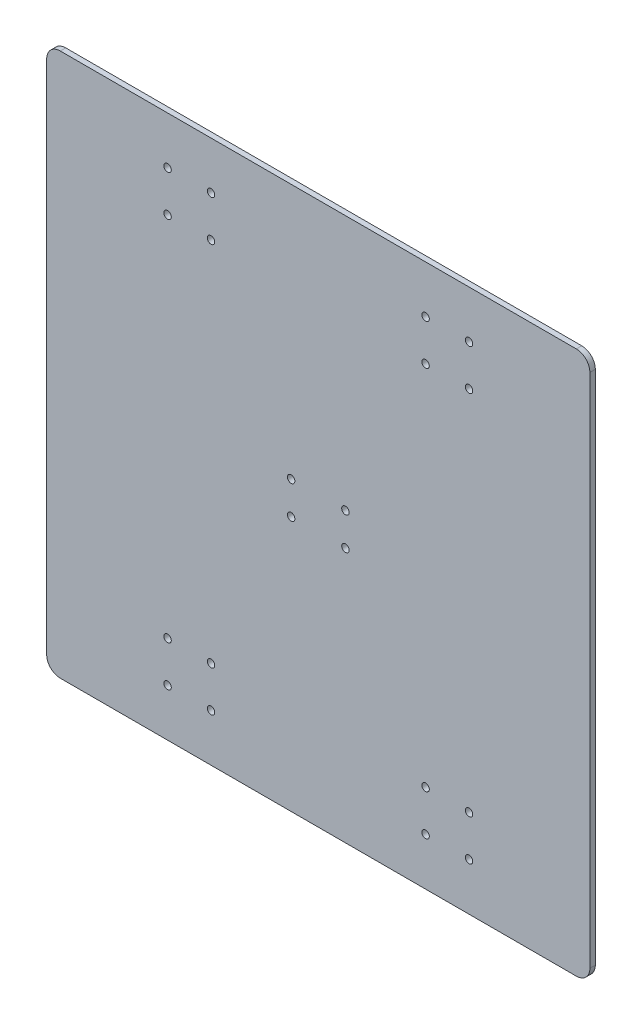
ISO-10303-21;
HEADER;
FILE_DESCRIPTION(('STEP AP214'),'2;1');
FILE_NAME('part.step','',(''),(''),'','','');
FILE_SCHEMA(('AUTOMOTIVE_DESIGN { 1 0 10303 214 1 1 1 1 }'));
ENDSEC;
DATA;
#1=APPLICATION_CONTEXT('core data for automotive mechanical design processes');
#2=APPLICATION_PROTOCOL_DEFINITION('international standard','automotive_design',2000,#1);
#3=PRODUCT_CONTEXT('',#1,'mechanical');
#4=PRODUCT('Part','Part','',(#3));
#5=PRODUCT_RELATED_PRODUCT_CATEGORY('part','',(#4));
#6=PRODUCT_DEFINITION_FORMATION('','',#4);
#7=PRODUCT_DEFINITION_CONTEXT('part definition',#1,'design');
#8=PRODUCT_DEFINITION('design','',#6,#7);
#9=PRODUCT_DEFINITION_SHAPE('','',#8);
#10=(LENGTH_UNIT() NAMED_UNIT(*) SI_UNIT(.MILLI.,.METRE.));
#11=(NAMED_UNIT(*) PLANE_ANGLE_UNIT() SI_UNIT($,.RADIAN.));
#12=(NAMED_UNIT(*) SI_UNIT($,.STERADIAN.) SOLID_ANGLE_UNIT());
#13=UNCERTAINTY_MEASURE_WITH_UNIT(LENGTH_MEASURE(1.E-05),#10,'distance_accuracy_value','');
#14=(GEOMETRIC_REPRESENTATION_CONTEXT(3) GLOBAL_UNCERTAINTY_ASSIGNED_CONTEXT((#13)) GLOBAL_UNIT_ASSIGNED_CONTEXT((#10,
#11,#12)) REPRESENTATION_CONTEXT('',''));
#15=CARTESIAN_POINT('',(0.,0.,0.));
#16=DIRECTION('',(0.,0.,1.));
#17=DIRECTION('',(1.,0.,0.));
#18=AXIS2_PLACEMENT_3D('',#15,#16,#17);
#19=CARTESIAN_POINT('',(0.,0.,4.));
#20=DIRECTION('',(0.,0.,-1.));
#21=DIRECTION('',(-1.,0.,0.));
#22=AXIS2_PLACEMENT_3D('',#19,#20,#21);
#23=PLANE('',#22);
#24=CARTESIAN_POINT('',(20.,12.,4.));
#25=DIRECTION('',(0.,0.,1.));
#26=DIRECTION('',(1.,0.,0.));
#27=AXIS2_PLACEMENT_3D('',#24,#25,#26);
#28=CIRCLE('',#27,2.74999999999999);
#29=CARTESIAN_POINT('',(22.75,12.,4.));
#30=VERTEX_POINT('',#29);
#31=EDGE_CURVE('E297',#30,#30,#28,.T.);
#32=ORIENTED_EDGE('',*,*,#31,.F.);
#33=EDGE_LOOP('',(#32));
#34=FACE_BOUND('',#33,.T.);
#35=CARTESIAN_POINT('',(-20.,12.,4.));
#36=DIRECTION('',(0.,0.,1.));
#37=DIRECTION('',(1.,0.,0.));
#38=AXIS2_PLACEMENT_3D('',#35,#36,#37);
#39=CIRCLE('',#38,2.74999999999999);
#40=CARTESIAN_POINT('',(-17.25,12.,4.));
#41=VERTEX_POINT('',#40);
#42=EDGE_CURVE('E291',#41,#41,#39,.T.);
#43=ORIENTED_EDGE('',*,*,#42,.F.);
#44=EDGE_LOOP('',(#43));
#45=FACE_BOUND('',#44,.T.);
#46=CARTESIAN_POINT('',(-20.,-12.,4.));
#47=DIRECTION('',(0.,0.,1.));
#48=DIRECTION('',(1.,0.,0.));
#49=AXIS2_PLACEMENT_3D('',#46,#47,#48);
#50=CIRCLE('',#49,2.74999999999999);
#51=CARTESIAN_POINT('',(-17.25,-12.,4.));
#52=VERTEX_POINT('',#51);
#53=EDGE_CURVE('E285',#52,#52,#50,.T.);
#54=ORIENTED_EDGE('',*,*,#53,.F.);
#55=EDGE_LOOP('',(#54));
#56=FACE_BOUND('',#55,.T.);
#57=CARTESIAN_POINT('',(79.,-165.,4.));
#58=DIRECTION('',(0.,0.,1.));
#59=DIRECTION('',(1.,0.,0.));
#60=AXIS2_PLACEMENT_3D('',#57,#58,#59);
#61=CIRCLE('',#60,2.75);
#62=CARTESIAN_POINT('',(81.75,-165.,4.));
#63=VERTEX_POINT('',#62);
#64=EDGE_CURVE('E270',#63,#63,#61,.T.);
#65=ORIENTED_EDGE('',*,*,#64,.F.);
#66=EDGE_LOOP('',(#65));
#67=FACE_BOUND('',#66,.T.);
#68=CARTESIAN_POINT('',(111.,-165.,4.));
#69=DIRECTION('',(0.,0.,1.));
#70=DIRECTION('',(1.,0.,0.));
#71=AXIS2_PLACEMENT_3D('',#68,#69,#70);
#72=CIRCLE('',#71,2.75);
#73=CARTESIAN_POINT('',(113.75,-165.,4.));
#74=VERTEX_POINT('',#73);
#75=EDGE_CURVE('E264',#74,#74,#72,.T.);
#76=ORIENTED_EDGE('',*,*,#75,.F.);
#77=EDGE_LOOP('',(#76));
#78=FACE_BOUND('',#77,.T.);
#79=CARTESIAN_POINT('',(111.,-135.,4.));
#80=DIRECTION('',(0.,0.,1.));
#81=DIRECTION('',(1.,0.,0.));
#82=AXIS2_PLACEMENT_3D('',#79,#80,#81);
#83=CIRCLE('',#82,2.75);
#84=CARTESIAN_POINT('',(113.75,-135.,4.));
#85=VERTEX_POINT('',#84);
#86=EDGE_CURVE('E258',#85,#85,#83,.T.);
#87=ORIENTED_EDGE('',*,*,#86,.F.);
#88=EDGE_LOOP('',(#87));
#89=FACE_BOUND('',#88,.T.);
#90=CARTESIAN_POINT('',(79.,-135.,4.));
#91=DIRECTION('',(0.,0.,1.));
#92=DIRECTION('',(1.,0.,0.));
#93=AXIS2_PLACEMENT_3D('',#90,#91,#92);
#94=CIRCLE('',#93,2.75);
#95=CARTESIAN_POINT('',(81.75,-135.,4.));
#96=VERTEX_POINT('',#95);
#97=EDGE_CURVE('E252',#96,#96,#94,.T.);
#98=ORIENTED_EDGE('',*,*,#97,.F.);
#99=EDGE_LOOP('',(#98));
#100=FACE_BOUND('',#99,.T.);
#101=CARTESIAN_POINT('',(79.,165.,4.));
#102=DIRECTION('',(0.,0.,1.));
#103=DIRECTION('',(1.,0.,0.));
#104=AXIS2_PLACEMENT_3D('',#101,#102,#103);
#105=CIRCLE('',#104,2.75);
#106=CARTESIAN_POINT('',(81.75,165.,4.));
#107=VERTEX_POINT('',#106);
#108=EDGE_CURVE('E249',#107,#107,#105,.T.);
#109=ORIENTED_EDGE('',*,*,#108,.F.);
#110=EDGE_LOOP('',(#109));
#111=FACE_BOUND('',#110,.T.);
#112=CARTESIAN_POINT('',(79.,135.,4.));
#113=DIRECTION('',(0.,0.,1.));
#114=DIRECTION('',(1.,0.,0.));
#115=AXIS2_PLACEMENT_3D('',#112,#113,#114);
#116=CIRCLE('',#115,2.75);
#117=CARTESIAN_POINT('',(81.75,135.,4.));
#118=VERTEX_POINT('',#117);
#119=EDGE_CURVE('E243',#118,#118,#116,.T.);
#120=ORIENTED_EDGE('',*,*,#119,.F.);
#121=EDGE_LOOP('',(#120));
#122=FACE_BOUND('',#121,.T.);
#123=CARTESIAN_POINT('',(111.,135.,4.));
#124=DIRECTION('',(0.,0.,1.));
#125=DIRECTION('',(1.,0.,0.));
#126=AXIS2_PLACEMENT_3D('',#123,#124,#125);
#127=CIRCLE('',#126,2.75);
#128=CARTESIAN_POINT('',(113.75,135.,4.));
#129=VERTEX_POINT('',#128);
#130=EDGE_CURVE('E237',#129,#129,#127,.T.);
#131=ORIENTED_EDGE('',*,*,#130,.F.);
#132=EDGE_LOOP('',(#131));
#133=FACE_BOUND('',#132,.T.);
#134=CARTESIAN_POINT('',(111.,165.,4.));
#135=DIRECTION('',(0.,0.,1.));
#136=DIRECTION('',(1.,0.,0.));
#137=AXIS2_PLACEMENT_3D('',#134,#135,#136);
#138=CIRCLE('',#137,2.75);
#139=CARTESIAN_POINT('',(113.75,165.,4.));
#140=VERTEX_POINT('',#139);
#141=EDGE_CURVE('E137',#140,#140,#138,.T.);
#142=ORIENTED_EDGE('',*,*,#141,.F.);
#143=EDGE_LOOP('',(#142));
#144=FACE_BOUND('',#143,.T.);
#145=DIRECTION('',(1.,0.,0.));
#146=VECTOR('',#145,1.);
#147=CARTESIAN_POINT('',(-200.,-200.,4.));
#148=LINE('',#147,#146);
#149=CARTESIAN_POINT('',(-190.,-200.,4.));
#150=VERTEX_POINT('',#149);
#151=CARTESIAN_POINT('',(190.,-200.,4.));
#152=VERTEX_POINT('',#151);
#153=EDGE_CURVE('E140',#150,#152,#148,.T.);
#154=ORIENTED_EDGE('',*,*,#153,.T.);
#155=CARTESIAN_POINT('',(190.,-190.,4.));
#156=DIRECTION('',(0.,0.,-1.));
#157=DIRECTION('',(-1.,0.,0.));
#158=AXIS2_PLACEMENT_3D('',#155,#156,#157);
#159=CIRCLE('',#158,10.);
#160=CARTESIAN_POINT('',(200.,-190.,4.));
#161=VERTEX_POINT('',#160);
#162=EDGE_CURVE('E207',#152,#161,#159,.F.);
#163=ORIENTED_EDGE('',*,*,#162,.T.);
#164=DIRECTION('',(0.,1.,0.));
#165=VECTOR('',#164,1.);
#166=CARTESIAN_POINT('',(200.,-200.,4.));
#167=LINE('',#166,#165);
#168=CARTESIAN_POINT('',(200.,190.,4.));
#169=VERTEX_POINT('',#168);
#170=EDGE_CURVE('E123',#161,#169,#167,.T.);
#171=ORIENTED_EDGE('',*,*,#170,.T.);
#172=CARTESIAN_POINT('',(190.,190.,4.));
#173=DIRECTION('',(0.,0.,-1.));
#174=DIRECTION('',(-1.,0.,0.));
#175=AXIS2_PLACEMENT_3D('',#172,#173,#174);
#176=CIRCLE('',#175,10.);
#177=CARTESIAN_POINT('',(190.,200.,4.));
#178=VERTEX_POINT('',#177);
#179=EDGE_CURVE('E202',#169,#178,#176,.F.);
#180=ORIENTED_EDGE('',*,*,#179,.T.);
#181=DIRECTION('',(-1.,0.,0.));
#182=VECTOR('',#181,1.);
#183=CARTESIAN_POINT('',(-200.,200.,4.));
#184=LINE('',#183,#182);
#185=CARTESIAN_POINT('',(-190.,200.,4.));
#186=VERTEX_POINT('',#185);
#187=EDGE_CURVE('E218',#178,#186,#184,.T.);
#188=ORIENTED_EDGE('',*,*,#187,.T.);
#189=CARTESIAN_POINT('',(-190.,190.,4.));
#190=DIRECTION('',(0.,0.,-1.));
#191=DIRECTION('',(-1.,0.,0.));
#192=AXIS2_PLACEMENT_3D('',#189,#190,#191);
#193=CIRCLE('',#192,10.);
#194=CARTESIAN_POINT('',(-200.,190.,4.));
#195=VERTEX_POINT('',#194);
#196=EDGE_CURVE('E59',#186,#195,#193,.F.);
#197=ORIENTED_EDGE('',*,*,#196,.T.);
#198=DIRECTION('',(0.,-1.,0.));
#199=VECTOR('',#198,1.);
#200=CARTESIAN_POINT('',(-200.,-200.,4.));
#201=LINE('',#200,#199);
#202=CARTESIAN_POINT('',(-200.,-190.,4.));
#203=VERTEX_POINT('',#202);
#204=EDGE_CURVE('E226',#195,#203,#201,.T.);
#205=ORIENTED_EDGE('',*,*,#204,.T.);
#206=CARTESIAN_POINT('',(-190.,-190.,4.));
#207=DIRECTION('',(0.,0.,-1.));
#208=DIRECTION('',(-1.,0.,0.));
#209=AXIS2_PLACEMENT_3D('',#206,#207,#208);
#210=CIRCLE('',#209,10.);
#211=EDGE_CURVE('E205',#203,#150,#210,.F.);
#212=ORIENTED_EDGE('',*,*,#211,.T.);
#213=EDGE_LOOP('',(#154,#163,#171,#180,#188,#197,#205,#212));
#214=FACE_BOUND('',#213,.T.);
#215=CARTESIAN_POINT('',(-111.,165.,4.));
#216=DIRECTION('',(0.,0.,1.));
#217=DIRECTION('',(1.,0.,0.));
#218=AXIS2_PLACEMENT_3D('',#215,#216,#217);
#219=CIRCLE('',#218,2.75);
#220=CARTESIAN_POINT('',(-108.25,165.,4.));
#221=VERTEX_POINT('',#220);
#222=EDGE_CURVE('E149',#221,#221,#219,.T.);
#223=ORIENTED_EDGE('',*,*,#222,.F.);
#224=EDGE_LOOP('',(#223));
#225=FACE_BOUND('',#224,.T.);
#226=CARTESIAN_POINT('',(-111.,-135.,4.));
#227=DIRECTION('',(0.,0.,1.));
#228=DIRECTION('',(1.,0.,0.));
#229=AXIS2_PLACEMENT_3D('',#226,#227,#228);
#230=CIRCLE('',#229,2.75);
#231=CARTESIAN_POINT('',(-108.25,-135.,4.));
#232=VERTEX_POINT('',#231);
#233=EDGE_CURVE('E155',#232,#232,#230,.T.);
#234=ORIENTED_EDGE('',*,*,#233,.F.);
#235=EDGE_LOOP('',(#234));
#236=FACE_BOUND('',#235,.T.);
#237=CARTESIAN_POINT('',(-79.,165.,4.));
#238=DIRECTION('',(0.,0.,1.));
#239=DIRECTION('',(1.,0.,0.));
#240=AXIS2_PLACEMENT_3D('',#237,#238,#239);
#241=CIRCLE('',#240,2.75);
#242=CARTESIAN_POINT('',(-76.25,165.,4.));
#243=VERTEX_POINT('',#242);
#244=EDGE_CURVE('E161',#243,#243,#241,.T.);
#245=ORIENTED_EDGE('',*,*,#244,.F.);
#246=EDGE_LOOP('',(#245));
#247=FACE_BOUND('',#246,.T.);
#248=CARTESIAN_POINT('',(-79.,-135.,4.));
#249=DIRECTION('',(0.,0.,1.));
#250=DIRECTION('',(1.,0.,0.));
#251=AXIS2_PLACEMENT_3D('',#248,#249,#250);
#252=CIRCLE('',#251,2.75);
#253=CARTESIAN_POINT('',(-76.25,-135.,4.));
#254=VERTEX_POINT('',#253);
#255=EDGE_CURVE('E167',#254,#254,#252,.T.);
#256=ORIENTED_EDGE('',*,*,#255,.F.);
#257=EDGE_LOOP('',(#256));
#258=FACE_BOUND('',#257,.T.);
#259=CARTESIAN_POINT('',(-79.,135.,4.));
#260=DIRECTION('',(0.,0.,1.));
#261=DIRECTION('',(1.,0.,0.));
#262=AXIS2_PLACEMENT_3D('',#259,#260,#261);
#263=CIRCLE('',#262,2.75);
#264=CARTESIAN_POINT('',(-76.25,135.,4.));
#265=VERTEX_POINT('',#264);
#266=EDGE_CURVE('E173',#265,#265,#263,.T.);
#267=ORIENTED_EDGE('',*,*,#266,.F.);
#268=EDGE_LOOP('',(#267));
#269=FACE_BOUND('',#268,.T.);
#270=CARTESIAN_POINT('',(-79.,-165.,4.));
#271=DIRECTION('',(0.,0.,1.));
#272=DIRECTION('',(1.,0.,0.));
#273=AXIS2_PLACEMENT_3D('',#270,#271,#272);
#274=CIRCLE('',#273,2.75);
#275=CARTESIAN_POINT('',(-76.25,-165.,4.));
#276=VERTEX_POINT('',#275);
#277=EDGE_CURVE('E179',#276,#276,#274,.T.);
#278=ORIENTED_EDGE('',*,*,#277,.F.);
#279=EDGE_LOOP('',(#278));
#280=FACE_BOUND('',#279,.T.);
#281=CARTESIAN_POINT('',(-111.,135.,4.));
#282=DIRECTION('',(0.,0.,1.));
#283=DIRECTION('',(1.,0.,0.));
#284=AXIS2_PLACEMENT_3D('',#281,#282,#283);
#285=CIRCLE('',#284,2.75);
#286=CARTESIAN_POINT('',(-108.25,135.,4.));
#287=VERTEX_POINT('',#286);
#288=EDGE_CURVE('E185',#287,#287,#285,.T.);
#289=ORIENTED_EDGE('',*,*,#288,.F.);
#290=EDGE_LOOP('',(#289));
#291=FACE_BOUND('',#290,.T.);
#292=CARTESIAN_POINT('',(-111.,-165.,4.));
#293=DIRECTION('',(0.,0.,1.));
#294=DIRECTION('',(1.,0.,0.));
#295=AXIS2_PLACEMENT_3D('',#292,#293,#294);
#296=CIRCLE('',#295,2.75);
#297=CARTESIAN_POINT('',(-108.25,-165.,4.));
#298=VERTEX_POINT('',#297);
#299=EDGE_CURVE('E191',#298,#298,#296,.T.);
#300=ORIENTED_EDGE('',*,*,#299,.F.);
#301=EDGE_LOOP('',(#300));
#302=FACE_BOUND('',#301,.T.);
#303=CARTESIAN_POINT('',(20.,-12.,4.));
#304=DIRECTION('',(0.,0.,1.));
#305=DIRECTION('',(1.,0.,0.));
#306=AXIS2_PLACEMENT_3D('',#303,#304,#305);
#307=CIRCLE('',#306,2.74999999999999);
#308=CARTESIAN_POINT('',(22.75,-12.,4.));
#309=VERTEX_POINT('',#308);
#310=EDGE_CURVE('E279',#309,#309,#307,.T.);
#311=ORIENTED_EDGE('',*,*,#310,.F.);
#312=EDGE_LOOP('',(#311));
#313=FACE_BOUND('',#312,.T.);
#314=ADVANCED_FACE('F37',(#34,#45,#56,#67,#78,#89,#100,#111,#122,#133,#144,#214,#225,#236,#247,
#258,#269,#280,#291,#302,#313),#23,.F.);
#315=CARTESIAN_POINT('',(0.,0.,0.));
#316=DIRECTION('',(0.,0.,-1.));
#317=DIRECTION('',(-1.,0.,0.));
#318=AXIS2_PLACEMENT_3D('',#315,#316,#317);
#319=PLANE('',#318);
#320=CARTESIAN_POINT('',(20.,12.,0.));
#321=DIRECTION('',(0.,0.,1.));
#322=DIRECTION('',(1.,0.,0.));
#323=AXIS2_PLACEMENT_3D('',#320,#321,#322);
#324=CIRCLE('',#323,2.75);
#325=CARTESIAN_POINT('',(22.75,12.,0.));
#326=VERTEX_POINT('',#325);
#327=EDGE_CURVE('E294',#326,#326,#324,.T.);
#328=ORIENTED_EDGE('',*,*,#327,.T.);
#329=EDGE_LOOP('',(#328));
#330=FACE_BOUND('',#329,.T.);
#331=CARTESIAN_POINT('',(-20.,12.,0.));
#332=DIRECTION('',(0.,0.,1.));
#333=DIRECTION('',(1.,0.,0.));
#334=AXIS2_PLACEMENT_3D('',#331,#332,#333);
#335=CIRCLE('',#334,2.75);
#336=CARTESIAN_POINT('',(-17.25,12.,0.));
#337=VERTEX_POINT('',#336);
#338=EDGE_CURVE('E288',#337,#337,#335,.T.);
#339=ORIENTED_EDGE('',*,*,#338,.T.);
#340=EDGE_LOOP('',(#339));
#341=FACE_BOUND('',#340,.T.);
#342=CARTESIAN_POINT('',(-20.,-12.,0.));
#343=DIRECTION('',(0.,0.,1.));
#344=DIRECTION('',(1.,0.,0.));
#345=AXIS2_PLACEMENT_3D('',#342,#343,#344);
#346=CIRCLE('',#345,2.75);
#347=CARTESIAN_POINT('',(-17.25,-12.,0.));
#348=VERTEX_POINT('',#347);
#349=EDGE_CURVE('E282',#348,#348,#346,.T.);
#350=ORIENTED_EDGE('',*,*,#349,.T.);
#351=EDGE_LOOP('',(#350));
#352=FACE_BOUND('',#351,.T.);
#353=CARTESIAN_POINT('',(-111.,-165.,0.));
#354=DIRECTION('',(0.,0.,1.));
#355=DIRECTION('',(1.,0.,0.));
#356=AXIS2_PLACEMENT_3D('',#353,#354,#355);
#357=CIRCLE('',#356,2.75);
#358=CARTESIAN_POINT('',(-108.25,-165.,0.));
#359=VERTEX_POINT('',#358);
#360=EDGE_CURVE('E188',#359,#359,#357,.T.);
#361=ORIENTED_EDGE('',*,*,#360,.T.);
#362=EDGE_LOOP('',(#361));
#363=FACE_BOUND('',#362,.T.);
#364=CARTESIAN_POINT('',(-111.,135.,0.));
#365=DIRECTION('',(0.,0.,1.));
#366=DIRECTION('',(1.,0.,0.));
#367=AXIS2_PLACEMENT_3D('',#364,#365,#366);
#368=CIRCLE('',#367,2.75);
#369=CARTESIAN_POINT('',(-108.25,135.,0.));
#370=VERTEX_POINT('',#369);
#371=EDGE_CURVE('E182',#370,#370,#368,.T.);
#372=ORIENTED_EDGE('',*,*,#371,.T.);
#373=EDGE_LOOP('',(#372));
#374=FACE_BOUND('',#373,.T.);
#375=CARTESIAN_POINT('',(-79.,-165.,0.));
#376=DIRECTION('',(0.,0.,1.));
#377=DIRECTION('',(1.,0.,0.));
#378=AXIS2_PLACEMENT_3D('',#375,#376,#377);
#379=CIRCLE('',#378,2.75);
#380=CARTESIAN_POINT('',(-76.25,-165.,0.));
#381=VERTEX_POINT('',#380);
#382=EDGE_CURVE('E176',#381,#381,#379,.T.);
#383=ORIENTED_EDGE('',*,*,#382,.T.);
#384=EDGE_LOOP('',(#383));
#385=FACE_BOUND('',#384,.T.);
#386=CARTESIAN_POINT('',(-79.,135.,0.));
#387=DIRECTION('',(0.,0.,1.));
#388=DIRECTION('',(1.,0.,0.));
#389=AXIS2_PLACEMENT_3D('',#386,#387,#388);
#390=CIRCLE('',#389,2.75);
#391=CARTESIAN_POINT('',(-76.25,135.,0.));
#392=VERTEX_POINT('',#391);
#393=EDGE_CURVE('E170',#392,#392,#390,.T.);
#394=ORIENTED_EDGE('',*,*,#393,.T.);
#395=EDGE_LOOP('',(#394));
#396=FACE_BOUND('',#395,.T.);
#397=CARTESIAN_POINT('',(-79.,-135.,0.));
#398=DIRECTION('',(0.,0.,1.));
#399=DIRECTION('',(1.,0.,0.));
#400=AXIS2_PLACEMENT_3D('',#397,#398,#399);
#401=CIRCLE('',#400,2.75);
#402=CARTESIAN_POINT('',(-76.25,-135.,0.));
#403=VERTEX_POINT('',#402);
#404=EDGE_CURVE('E164',#403,#403,#401,.T.);
#405=ORIENTED_EDGE('',*,*,#404,.T.);
#406=EDGE_LOOP('',(#405));
#407=FACE_BOUND('',#406,.T.);
#408=CARTESIAN_POINT('',(-79.,165.,0.));
#409=DIRECTION('',(0.,0.,1.));
#410=DIRECTION('',(1.,0.,0.));
#411=AXIS2_PLACEMENT_3D('',#408,#409,#410);
#412=CIRCLE('',#411,2.75);
#413=CARTESIAN_POINT('',(-76.25,165.,0.));
#414=VERTEX_POINT('',#413);
#415=EDGE_CURVE('E158',#414,#414,#412,.T.);
#416=ORIENTED_EDGE('',*,*,#415,.T.);
#417=EDGE_LOOP('',(#416));
#418=FACE_BOUND('',#417,.T.);
#419=CARTESIAN_POINT('',(-111.,-135.,0.));
#420=DIRECTION('',(0.,0.,1.));
#421=DIRECTION('',(1.,0.,0.));
#422=AXIS2_PLACEMENT_3D('',#419,#420,#421);
#423=CIRCLE('',#422,2.75);
#424=CARTESIAN_POINT('',(-108.25,-135.,0.));
#425=VERTEX_POINT('',#424);
#426=EDGE_CURVE('E152',#425,#425,#423,.T.);
#427=ORIENTED_EDGE('',*,*,#426,.T.);
#428=EDGE_LOOP('',(#427));
#429=FACE_BOUND('',#428,.T.);
#430=CARTESIAN_POINT('',(-111.,165.,0.));
#431=DIRECTION('',(0.,0.,1.));
#432=DIRECTION('',(1.,0.,0.));
#433=AXIS2_PLACEMENT_3D('',#430,#431,#432);
#434=CIRCLE('',#433,2.75);
#435=CARTESIAN_POINT('',(-108.25,165.,0.));
#436=VERTEX_POINT('',#435);
#437=EDGE_CURVE('E146',#436,#436,#434,.T.);
#438=ORIENTED_EDGE('',*,*,#437,.T.);
#439=EDGE_LOOP('',(#438));
#440=FACE_BOUND('',#439,.T.);
#441=DIRECTION('',(0.,1.,0.));
#442=VECTOR('',#441,1.);
#443=CARTESIAN_POINT('',(200.,-200.,0.));
#444=LINE('',#443,#442);
#445=CARTESIAN_POINT('',(200.,-190.,0.));
#446=VERTEX_POINT('',#445);
#447=CARTESIAN_POINT('',(200.,190.,0.));
#448=VERTEX_POINT('',#447);
#449=EDGE_CURVE('E120',#446,#448,#444,.T.);
#450=ORIENTED_EDGE('',*,*,#449,.F.);
#451=CARTESIAN_POINT('',(190.,-190.,0.));
#452=DIRECTION('',(0.,0.,-1.));
#453=DIRECTION('',(-1.,0.,0.));
#454=AXIS2_PLACEMENT_3D('',#451,#452,#453);
#455=CIRCLE('',#454,10.);
#456=CARTESIAN_POINT('',(190.,-200.,0.));
#457=VERTEX_POINT('',#456);
#458=EDGE_CURVE('E103',#446,#457,#455,.T.);
#459=ORIENTED_EDGE('',*,*,#458,.T.);
#460=DIRECTION('',(1.,0.,0.));
#461=VECTOR('',#460,1.);
#462=CARTESIAN_POINT('',(-200.,-200.,0.));
#463=LINE('',#462,#461);
#464=CARTESIAN_POINT('',(-190.,-200.,0.));
#465=VERTEX_POINT('',#464);
#466=EDGE_CURVE('E144',#465,#457,#463,.T.);
#467=ORIENTED_EDGE('',*,*,#466,.F.);
#468=CARTESIAN_POINT('',(-190.,-190.,0.));
#469=DIRECTION('',(0.,0.,-1.));
#470=DIRECTION('',(-1.,0.,0.));
#471=AXIS2_PLACEMENT_3D('',#468,#469,#470);
#472=CIRCLE('',#471,10.);
#473=CARTESIAN_POINT('',(-200.,-190.,0.));
#474=VERTEX_POINT('',#473);
#475=EDGE_CURVE('E114',#465,#474,#472,.T.);
#476=ORIENTED_EDGE('',*,*,#475,.T.);
#477=DIRECTION('',(0.,-1.,0.));
#478=VECTOR('',#477,1.);
#479=CARTESIAN_POINT('',(-200.,-200.,0.));
#480=LINE('',#479,#478);
#481=CARTESIAN_POINT('',(-200.,190.,0.));
#482=VERTEX_POINT('',#481);
#483=EDGE_CURVE('E134',#482,#474,#480,.T.);
#484=ORIENTED_EDGE('',*,*,#483,.F.);
#485=CARTESIAN_POINT('',(-190.,190.,0.));
#486=DIRECTION('',(0.,0.,-1.));
#487=DIRECTION('',(-1.,0.,0.));
#488=AXIS2_PLACEMENT_3D('',#485,#486,#487);
#489=CIRCLE('',#488,10.);
#490=CARTESIAN_POINT('',(-190.,200.,0.));
#491=VERTEX_POINT('',#490);
#492=EDGE_CURVE('E196',#482,#491,#489,.T.);
#493=ORIENTED_EDGE('',*,*,#492,.T.);
#494=DIRECTION('',(-1.,0.,0.));
#495=VECTOR('',#494,1.);
#496=CARTESIAN_POINT('',(-200.,200.,0.));
#497=LINE('',#496,#495);
#498=CARTESIAN_POINT('',(190.,200.,0.));
#499=VERTEX_POINT('',#498);
#500=EDGE_CURVE('E130',#499,#491,#497,.T.);
#501=ORIENTED_EDGE('',*,*,#500,.F.);
#502=CARTESIAN_POINT('',(190.,190.,0.));
#503=DIRECTION('',(0.,0.,-1.));
#504=DIRECTION('',(-1.,0.,0.));
#505=AXIS2_PLACEMENT_3D('',#502,#503,#504);
#506=CIRCLE('',#505,10.);
#507=EDGE_CURVE('E124',#499,#448,#506,.T.);
#508=ORIENTED_EDGE('',*,*,#507,.T.);
#509=EDGE_LOOP('',(#450,#459,#467,#476,#484,#493,#501,#508));
#510=FACE_BOUND('',#509,.T.);
#511=CARTESIAN_POINT('',(111.,165.,0.));
#512=DIRECTION('',(0.,0.,1.));
#513=DIRECTION('',(1.,0.,0.));
#514=AXIS2_PLACEMENT_3D('',#511,#512,#513);
#515=CIRCLE('',#514,2.75);
#516=CARTESIAN_POINT('',(113.75,165.,0.));
#517=VERTEX_POINT('',#516);
#518=EDGE_CURVE('E131',#517,#517,#515,.T.);
#519=ORIENTED_EDGE('',*,*,#518,.T.);
#520=EDGE_LOOP('',(#519));
#521=FACE_BOUND('',#520,.T.);
#522=CARTESIAN_POINT('',(111.,135.,0.));
#523=DIRECTION('',(0.,0.,1.));
#524=DIRECTION('',(1.,0.,0.));
#525=AXIS2_PLACEMENT_3D('',#522,#523,#524);
#526=CIRCLE('',#525,2.75);
#527=CARTESIAN_POINT('',(113.75,135.,0.));
#528=VERTEX_POINT('',#527);
#529=EDGE_CURVE('E234',#528,#528,#526,.T.);
#530=ORIENTED_EDGE('',*,*,#529,.T.);
#531=EDGE_LOOP('',(#530));
#532=FACE_BOUND('',#531,.T.);
#533=CARTESIAN_POINT('',(79.,135.,0.));
#534=DIRECTION('',(0.,0.,1.));
#535=DIRECTION('',(1.,0.,0.));
#536=AXIS2_PLACEMENT_3D('',#533,#534,#535);
#537=CIRCLE('',#536,2.75);
#538=CARTESIAN_POINT('',(81.75,135.,0.));
#539=VERTEX_POINT('',#538);
#540=EDGE_CURVE('E240',#539,#539,#537,.T.);
#541=ORIENTED_EDGE('',*,*,#540,.T.);
#542=EDGE_LOOP('',(#541));
#543=FACE_BOUND('',#542,.T.);
#544=CARTESIAN_POINT('',(79.,165.,0.));
#545=DIRECTION('',(0.,0.,1.));
#546=DIRECTION('',(1.,0.,0.));
#547=AXIS2_PLACEMENT_3D('',#544,#545,#546);
#548=CIRCLE('',#547,2.75);
#549=CARTESIAN_POINT('',(81.75,165.,0.));
#550=VERTEX_POINT('',#549);
#551=EDGE_CURVE('E246',#550,#550,#548,.T.);
#552=ORIENTED_EDGE('',*,*,#551,.T.);
#553=EDGE_LOOP('',(#552));
#554=FACE_BOUND('',#553,.T.);
#555=CARTESIAN_POINT('',(79.,-135.,0.));
#556=DIRECTION('',(0.,0.,1.));
#557=DIRECTION('',(1.,0.,0.));
#558=AXIS2_PLACEMENT_3D('',#555,#556,#557);
#559=CIRCLE('',#558,2.75);
#560=CARTESIAN_POINT('',(81.75,-135.,0.));
#561=VERTEX_POINT('',#560);
#562=EDGE_CURVE('E255',#561,#561,#559,.T.);
#563=ORIENTED_EDGE('',*,*,#562,.T.);
#564=EDGE_LOOP('',(#563));
#565=FACE_BOUND('',#564,.T.);
#566=CARTESIAN_POINT('',(111.,-135.,0.));
#567=DIRECTION('',(0.,0.,1.));
#568=DIRECTION('',(1.,0.,0.));
#569=AXIS2_PLACEMENT_3D('',#566,#567,#568);
#570=CIRCLE('',#569,2.75);
#571=CARTESIAN_POINT('',(113.75,-135.,0.));
#572=VERTEX_POINT('',#571);
#573=EDGE_CURVE('E261',#572,#572,#570,.T.);
#574=ORIENTED_EDGE('',*,*,#573,.T.);
#575=EDGE_LOOP('',(#574));
#576=FACE_BOUND('',#575,.T.);
#577=CARTESIAN_POINT('',(111.,-165.,0.));
#578=DIRECTION('',(0.,0.,1.));
#579=DIRECTION('',(1.,0.,0.));
#580=AXIS2_PLACEMENT_3D('',#577,#578,#579);
#581=CIRCLE('',#580,2.75);
#582=CARTESIAN_POINT('',(113.75,-165.,0.));
#583=VERTEX_POINT('',#582);
#584=EDGE_CURVE('E267',#583,#583,#581,.T.);
#585=ORIENTED_EDGE('',*,*,#584,.T.);
#586=EDGE_LOOP('',(#585));
#587=FACE_BOUND('',#586,.T.);
#588=CARTESIAN_POINT('',(79.,-165.,0.));
#589=DIRECTION('',(0.,0.,1.));
#590=DIRECTION('',(1.,0.,0.));
#591=AXIS2_PLACEMENT_3D('',#588,#589,#590);
#592=CIRCLE('',#591,2.75);
#593=CARTESIAN_POINT('',(81.75,-165.,0.));
#594=VERTEX_POINT('',#593);
#595=EDGE_CURVE('E273',#594,#594,#592,.T.);
#596=ORIENTED_EDGE('',*,*,#595,.T.);
#597=EDGE_LOOP('',(#596));
#598=FACE_BOUND('',#597,.T.);
#599=CARTESIAN_POINT('',(20.,-12.,0.));
#600=DIRECTION('',(0.,0.,1.));
#601=DIRECTION('',(1.,0.,0.));
#602=AXIS2_PLACEMENT_3D('',#599,#600,#601);
#603=CIRCLE('',#602,2.75);
#604=CARTESIAN_POINT('',(22.75,-12.,0.));
#605=VERTEX_POINT('',#604);
#606=EDGE_CURVE('E276',#605,#605,#603,.T.);
#607=ORIENTED_EDGE('',*,*,#606,.T.);
#608=EDGE_LOOP('',(#607));
#609=FACE_BOUND('',#608,.T.);
#610=ADVANCED_FACE('F127',(#330,#341,#352,#363,#374,#385,#396,#407,#418,#429,#440,#510,#521,
#532,#543,#554,#565,#576,#587,#598,#609),#319,.T.);
#611=CARTESIAN_POINT('',(200.,-200.,4.));
#612=DIRECTION('',(-1.,0.,0.));
#613=DIRECTION('',(0.,0.,1.));
#614=AXIS2_PLACEMENT_3D('',#611,#612,#613);
#615=PLANE('',#614);
#616=ORIENTED_EDGE('',*,*,#170,.F.);
#617=DIRECTION('',(0.,0.,-1.));
#618=VECTOR('',#617,1.);
#619=CARTESIAN_POINT('',(200.,-190.,4.));
#620=LINE('',#619,#618);
#621=EDGE_CURVE('E107',#161,#446,#620,.T.);
#622=ORIENTED_EDGE('',*,*,#621,.T.);
#623=ORIENTED_EDGE('',*,*,#449,.T.);
#624=DIRECTION('',(0.,0.,-1.));
#625=VECTOR('',#624,1.);
#626=CARTESIAN_POINT('',(200.,190.,4.));
#627=LINE('',#626,#625);
#628=EDGE_CURVE('E125',#448,#169,#627,.F.);
#629=ORIENTED_EDGE('',*,*,#628,.T.);
#630=EDGE_LOOP('',(#616,#622,#623,#629));
#631=FACE_BOUND('',#630,.T.);
#632=ADVANCED_FACE('F119',(#631),#615,.F.);
#633=CARTESIAN_POINT('',(-200.,200.,4.));
#634=DIRECTION('',(0.,-1.,0.));
#635=DIRECTION('',(0.,0.,-1.));
#636=AXIS2_PLACEMENT_3D('',#633,#634,#635);
#637=PLANE('',#636);
#638=ORIENTED_EDGE('',*,*,#500,.T.);
#639=DIRECTION('',(0.,0.,-1.));
#640=VECTOR('',#639,1.);
#641=CARTESIAN_POINT('',(-190.,200.,4.));
#642=LINE('',#641,#640);
#643=EDGE_CURVE('E11',#491,#186,#642,.F.);
#644=ORIENTED_EDGE('',*,*,#643,.T.);
#645=ORIENTED_EDGE('',*,*,#187,.F.);
#646=DIRECTION('',(0.,0.,-1.));
#647=VECTOR('',#646,1.);
#648=CARTESIAN_POINT('',(190.,200.,4.));
#649=LINE('',#648,#647);
#650=EDGE_CURVE('E45',#178,#499,#649,.T.);
#651=ORIENTED_EDGE('',*,*,#650,.T.);
#652=EDGE_LOOP('',(#638,#644,#645,#651));
#653=FACE_BOUND('',#652,.T.);
#654=ADVANCED_FACE('F216',(#653),#637,.F.);
#655=CARTESIAN_POINT('',(-200.,-200.,4.));
#656=DIRECTION('',(1.,0.,0.));
#657=DIRECTION('',(0.,0.,-1.));
#658=AXIS2_PLACEMENT_3D('',#655,#656,#657);
#659=PLANE('',#658);
#660=ORIENTED_EDGE('',*,*,#483,.T.);
#661=DIRECTION('',(0.,0.,-1.));
#662=VECTOR('',#661,1.);
#663=CARTESIAN_POINT('',(-200.,-190.,4.));
#664=LINE('',#663,#662);
#665=EDGE_CURVE('E52',#474,#203,#664,.F.);
#666=ORIENTED_EDGE('',*,*,#665,.T.);
#667=ORIENTED_EDGE('',*,*,#204,.F.);
#668=DIRECTION('',(0.,0.,-1.));
#669=VECTOR('',#668,1.);
#670=CARTESIAN_POINT('',(-200.,190.,4.));
#671=LINE('',#670,#669);
#672=EDGE_CURVE('E209',#195,#482,#671,.T.);
#673=ORIENTED_EDGE('',*,*,#672,.T.);
#674=EDGE_LOOP('',(#660,#666,#667,#673));
#675=FACE_BOUND('',#674,.T.);
#676=ADVANCED_FACE('F225',(#675),#659,.F.);
#677=CARTESIAN_POINT('',(-200.,-200.,4.));
#678=DIRECTION('',(0.,1.,0.));
#679=DIRECTION('',(0.,0.,1.));
#680=AXIS2_PLACEMENT_3D('',#677,#678,#679);
#681=PLANE('',#680);
#682=ORIENTED_EDGE('',*,*,#466,.T.);
#683=DIRECTION('',(0.,0.,-1.));
#684=VECTOR('',#683,1.);
#685=CARTESIAN_POINT('',(190.,-200.,4.));
#686=LINE('',#685,#684);
#687=EDGE_CURVE('E108',#457,#152,#686,.F.);
#688=ORIENTED_EDGE('',*,*,#687,.T.);
#689=ORIENTED_EDGE('',*,*,#153,.F.);
#690=DIRECTION('',(0.,0.,-1.));
#691=VECTOR('',#690,1.);
#692=CARTESIAN_POINT('',(-190.,-200.,4.));
#693=LINE('',#692,#691);
#694=EDGE_CURVE('E113',#150,#465,#693,.T.);
#695=ORIENTED_EDGE('',*,*,#694,.T.);
#696=EDGE_LOOP('',(#682,#688,#689,#695));
#697=FACE_BOUND('',#696,.T.);
#698=ADVANCED_FACE('F400',(#697),#681,.F.);
#699=CARTESIAN_POINT('',(111.,165.,4.));
#700=DIRECTION('',(0.,0.,1.));
#701=DIRECTION('',(1.,0.,0.));
#702=AXIS2_PLACEMENT_3D('',#699,#700,#701);
#703=CYLINDRICAL_SURFACE('',#702,2.75);
#704=ORIENTED_EDGE('',*,*,#518,.F.);
#705=EDGE_LOOP('',(#704));
#706=FACE_BOUND('',#705,.T.);
#707=ORIENTED_EDGE('',*,*,#141,.T.);
#708=EDGE_LOOP('',(#707));
#709=FACE_BOUND('',#708,.T.);
#710=ADVANCED_FACE('F397',(#706,#709),#703,.F.);
#711=CARTESIAN_POINT('',(111.,135.,4.));
#712=DIRECTION('',(0.,0.,1.));
#713=DIRECTION('',(1.,0.,0.));
#714=AXIS2_PLACEMENT_3D('',#711,#712,#713);
#715=CYLINDRICAL_SURFACE('',#714,2.75);
#716=ORIENTED_EDGE('',*,*,#529,.F.);
#717=EDGE_LOOP('',(#716));
#718=FACE_BOUND('',#717,.T.);
#719=ORIENTED_EDGE('',*,*,#130,.T.);
#720=EDGE_LOOP('',(#719));
#721=FACE_BOUND('',#720,.T.);
#722=ADVANCED_FACE('F393',(#718,#721),#715,.F.);
#723=CARTESIAN_POINT('',(79.,135.,4.));
#724=DIRECTION('',(0.,0.,1.));
#725=DIRECTION('',(1.,0.,0.));
#726=AXIS2_PLACEMENT_3D('',#723,#724,#725);
#727=CYLINDRICAL_SURFACE('',#726,2.75);
#728=ORIENTED_EDGE('',*,*,#540,.F.);
#729=EDGE_LOOP('',(#728));
#730=FACE_BOUND('',#729,.T.);
#731=ORIENTED_EDGE('',*,*,#119,.T.);
#732=EDGE_LOOP('',(#731));
#733=FACE_BOUND('',#732,.T.);
#734=ADVANCED_FACE('F389',(#730,#733),#727,.F.);
#735=CARTESIAN_POINT('',(79.,165.,4.));
#736=DIRECTION('',(0.,0.,1.));
#737=DIRECTION('',(1.,0.,0.));
#738=AXIS2_PLACEMENT_3D('',#735,#736,#737);
#739=CYLINDRICAL_SURFACE('',#738,2.75);
#740=ORIENTED_EDGE('',*,*,#551,.F.);
#741=EDGE_LOOP('',(#740));
#742=FACE_BOUND('',#741,.T.);
#743=ORIENTED_EDGE('',*,*,#108,.T.);
#744=EDGE_LOOP('',(#743));
#745=FACE_BOUND('',#744,.T.);
#746=ADVANCED_FACE('F385',(#742,#745),#739,.F.);
#747=CARTESIAN_POINT('',(79.,-135.,4.));
#748=DIRECTION('',(0.,0.,1.));
#749=DIRECTION('',(1.,0.,0.));
#750=AXIS2_PLACEMENT_3D('',#747,#748,#749);
#751=CYLINDRICAL_SURFACE('',#750,2.75);
#752=ORIENTED_EDGE('',*,*,#562,.F.);
#753=EDGE_LOOP('',(#752));
#754=FACE_BOUND('',#753,.T.);
#755=ORIENTED_EDGE('',*,*,#97,.T.);
#756=EDGE_LOOP('',(#755));
#757=FACE_BOUND('',#756,.T.);
#758=ADVANCED_FACE('F381',(#754,#757),#751,.F.);
#759=CARTESIAN_POINT('',(-111.,165.,4.));
#760=DIRECTION('',(0.,0.,1.));
#761=DIRECTION('',(1.,0.,0.));
#762=AXIS2_PLACEMENT_3D('',#759,#760,#761);
#763=CYLINDRICAL_SURFACE('',#762,2.75);
#764=ORIENTED_EDGE('',*,*,#437,.F.);
#765=EDGE_LOOP('',(#764));
#766=FACE_BOUND('',#765,.T.);
#767=ORIENTED_EDGE('',*,*,#222,.T.);
#768=EDGE_LOOP('',(#767));
#769=FACE_BOUND('',#768,.T.);
#770=ADVANCED_FACE('F384',(#766,#769),#763,.F.);
#771=CARTESIAN_POINT('',(-111.,-135.,4.));
#772=DIRECTION('',(0.,0.,1.));
#773=DIRECTION('',(1.,0.,0.));
#774=AXIS2_PLACEMENT_3D('',#771,#772,#773);
#775=CYLINDRICAL_SURFACE('',#774,2.75);
#776=ORIENTED_EDGE('',*,*,#426,.F.);
#777=EDGE_LOOP('',(#776));
#778=FACE_BOUND('',#777,.T.);
#779=ORIENTED_EDGE('',*,*,#233,.T.);
#780=EDGE_LOOP('',(#779));
#781=FACE_BOUND('',#780,.T.);
#782=ADVANCED_FACE('F379',(#778,#781),#775,.F.);
#783=CARTESIAN_POINT('',(111.,-135.,4.));
#784=DIRECTION('',(0.,0.,1.));
#785=DIRECTION('',(1.,0.,0.));
#786=AXIS2_PLACEMENT_3D('',#783,#784,#785);
#787=CYLINDRICAL_SURFACE('',#786,2.75);
#788=ORIENTED_EDGE('',*,*,#573,.F.);
#789=EDGE_LOOP('',(#788));
#790=FACE_BOUND('',#789,.T.);
#791=ORIENTED_EDGE('',*,*,#86,.T.);
#792=EDGE_LOOP('',(#791));
#793=FACE_BOUND('',#792,.T.);
#794=ADVANCED_FACE('F375',(#790,#793),#787,.F.);
#795=CARTESIAN_POINT('',(-79.,165.,4.));
#796=DIRECTION('',(0.,0.,1.));
#797=DIRECTION('',(1.,0.,0.));
#798=AXIS2_PLACEMENT_3D('',#795,#796,#797);
#799=CYLINDRICAL_SURFACE('',#798,2.75);
#800=ORIENTED_EDGE('',*,*,#415,.F.);
#801=EDGE_LOOP('',(#800));
#802=FACE_BOUND('',#801,.T.);
#803=ORIENTED_EDGE('',*,*,#244,.T.);
#804=EDGE_LOOP('',(#803));
#805=FACE_BOUND('',#804,.T.);
#806=ADVANCED_FACE('F378',(#802,#805),#799,.F.);
#807=CARTESIAN_POINT('',(-79.,-135.,4.));
#808=DIRECTION('',(0.,0.,1.));
#809=DIRECTION('',(1.,0.,0.));
#810=AXIS2_PLACEMENT_3D('',#807,#808,#809);
#811=CYLINDRICAL_SURFACE('',#810,2.75);
#812=ORIENTED_EDGE('',*,*,#404,.F.);
#813=EDGE_LOOP('',(#812));
#814=FACE_BOUND('',#813,.T.);
#815=ORIENTED_EDGE('',*,*,#255,.T.);
#816=EDGE_LOOP('',(#815));
#817=FACE_BOUND('',#816,.T.);
#818=ADVANCED_FACE('F373',(#814,#817),#811,.F.);
#819=CARTESIAN_POINT('',(111.,-165.,4.));
#820=DIRECTION('',(0.,0.,1.));
#821=DIRECTION('',(1.,0.,0.));
#822=AXIS2_PLACEMENT_3D('',#819,#820,#821);
#823=CYLINDRICAL_SURFACE('',#822,2.75);
#824=ORIENTED_EDGE('',*,*,#584,.F.);
#825=EDGE_LOOP('',(#824));
#826=FACE_BOUND('',#825,.T.);
#827=ORIENTED_EDGE('',*,*,#75,.T.);
#828=EDGE_LOOP('',(#827));
#829=FACE_BOUND('',#828,.T.);
#830=ADVANCED_FACE('F369',(#826,#829),#823,.F.);
#831=CARTESIAN_POINT('',(-79.,135.,4.));
#832=DIRECTION('',(0.,0.,1.));
#833=DIRECTION('',(1.,0.,0.));
#834=AXIS2_PLACEMENT_3D('',#831,#832,#833);
#835=CYLINDRICAL_SURFACE('',#834,2.75);
#836=ORIENTED_EDGE('',*,*,#393,.F.);
#837=EDGE_LOOP('',(#836));
#838=FACE_BOUND('',#837,.T.);
#839=ORIENTED_EDGE('',*,*,#266,.T.);
#840=EDGE_LOOP('',(#839));
#841=FACE_BOUND('',#840,.T.);
#842=ADVANCED_FACE('F372',(#838,#841),#835,.F.);
#843=CARTESIAN_POINT('',(-79.,-165.,4.));
#844=DIRECTION('',(0.,0.,1.));
#845=DIRECTION('',(1.,0.,0.));
#846=AXIS2_PLACEMENT_3D('',#843,#844,#845);
#847=CYLINDRICAL_SURFACE('',#846,2.75);
#848=ORIENTED_EDGE('',*,*,#382,.F.);
#849=EDGE_LOOP('',(#848));
#850=FACE_BOUND('',#849,.T.);
#851=ORIENTED_EDGE('',*,*,#277,.T.);
#852=EDGE_LOOP('',(#851));
#853=FACE_BOUND('',#852,.T.);
#854=ADVANCED_FACE('F367',(#850,#853),#847,.F.);
#855=CARTESIAN_POINT('',(79.,-165.,4.));
#856=DIRECTION('',(0.,0.,1.));
#857=DIRECTION('',(1.,0.,0.));
#858=AXIS2_PLACEMENT_3D('',#855,#856,#857);
#859=CYLINDRICAL_SURFACE('',#858,2.75);
#860=ORIENTED_EDGE('',*,*,#595,.F.);
#861=EDGE_LOOP('',(#860));
#862=FACE_BOUND('',#861,.T.);
#863=ORIENTED_EDGE('',*,*,#64,.T.);
#864=EDGE_LOOP('',(#863));
#865=FACE_BOUND('',#864,.T.);
#866=ADVANCED_FACE('F364',(#862,#865),#859,.F.);
#867=CARTESIAN_POINT('',(-111.,135.,4.));
#868=DIRECTION('',(0.,0.,1.));
#869=DIRECTION('',(1.,0.,0.));
#870=AXIS2_PLACEMENT_3D('',#867,#868,#869);
#871=CYLINDRICAL_SURFACE('',#870,2.75);
#872=ORIENTED_EDGE('',*,*,#371,.F.);
#873=EDGE_LOOP('',(#872));
#874=FACE_BOUND('',#873,.T.);
#875=ORIENTED_EDGE('',*,*,#288,.T.);
#876=EDGE_LOOP('',(#875));
#877=FACE_BOUND('',#876,.T.);
#878=ADVANCED_FACE('F358',(#874,#877),#871,.F.);
#879=CARTESIAN_POINT('',(-111.,-165.,4.));
#880=DIRECTION('',(0.,0.,1.));
#881=DIRECTION('',(1.,0.,0.));
#882=AXIS2_PLACEMENT_3D('',#879,#880,#881);
#883=CYLINDRICAL_SURFACE('',#882,2.75);
#884=ORIENTED_EDGE('',*,*,#360,.F.);
#885=EDGE_LOOP('',(#884));
#886=FACE_BOUND('',#885,.T.);
#887=ORIENTED_EDGE('',*,*,#299,.T.);
#888=EDGE_LOOP('',(#887));
#889=FACE_BOUND('',#888,.T.);
#890=ADVANCED_FACE('F348',(#886,#889),#883,.F.);
#891=CARTESIAN_POINT('',(20.,-12.,4.));
#892=DIRECTION('',(0.,0.,1.));
#893=DIRECTION('',(1.,0.,0.));
#894=AXIS2_PLACEMENT_3D('',#891,#892,#893);
#895=CYLINDRICAL_SURFACE('',#894,2.74999999999999);
#896=ORIENTED_EDGE('',*,*,#606,.F.);
#897=EDGE_LOOP('',(#896));
#898=FACE_BOUND('',#897,.T.);
#899=ORIENTED_EDGE('',*,*,#310,.T.);
#900=EDGE_LOOP('',(#899));
#901=FACE_BOUND('',#900,.T.);
#902=ADVANCED_FACE('F345',(#898,#901),#895,.F.);
#903=CARTESIAN_POINT('',(-20.,-12.,4.));
#904=DIRECTION('',(0.,0.,1.));
#905=DIRECTION('',(1.,0.,0.));
#906=AXIS2_PLACEMENT_3D('',#903,#904,#905);
#907=CYLINDRICAL_SURFACE('',#906,2.74999999999999);
#908=ORIENTED_EDGE('',*,*,#349,.F.);
#909=EDGE_LOOP('',(#908));
#910=FACE_BOUND('',#909,.T.);
#911=ORIENTED_EDGE('',*,*,#53,.T.);
#912=EDGE_LOOP('',(#911));
#913=FACE_BOUND('',#912,.T.);
#914=ADVANCED_FACE('F347',(#910,#913),#907,.F.);
#915=CARTESIAN_POINT('',(-20.,12.,4.));
#916=DIRECTION('',(0.,0.,1.));
#917=DIRECTION('',(1.,0.,0.));
#918=AXIS2_PLACEMENT_3D('',#915,#916,#917);
#919=CYLINDRICAL_SURFACE('',#918,2.74999999999999);
#920=ORIENTED_EDGE('',*,*,#338,.F.);
#921=EDGE_LOOP('',(#920));
#922=FACE_BOUND('',#921,.T.);
#923=ORIENTED_EDGE('',*,*,#42,.T.);
#924=EDGE_LOOP('',(#923));
#925=FACE_BOUND('',#924,.T.);
#926=ADVANCED_FACE('F355',(#922,#925),#919,.F.);
#927=CARTESIAN_POINT('',(20.,12.,4.));
#928=DIRECTION('',(0.,0.,1.));
#929=DIRECTION('',(1.,0.,0.));
#930=AXIS2_PLACEMENT_3D('',#927,#928,#929);
#931=CYLINDRICAL_SURFACE('',#930,2.74999999999999);
#932=ORIENTED_EDGE('',*,*,#327,.F.);
#933=EDGE_LOOP('',(#932));
#934=FACE_BOUND('',#933,.T.);
#935=ORIENTED_EDGE('',*,*,#31,.T.);
#936=EDGE_LOOP('',(#935));
#937=FACE_BOUND('',#936,.T.);
#938=ADVANCED_FACE('F301',(#934,#937),#931,.F.);
#939=CARTESIAN_POINT('',(190.,-190.,4.));
#940=DIRECTION('',(0.,0.,-1.));
#941=DIRECTION('',(-1.,0.,0.));
#942=AXIS2_PLACEMENT_3D('',#939,#940,#941);
#943=CYLINDRICAL_SURFACE('',#942,10.);
#944=ORIENTED_EDGE('',*,*,#162,.F.);
#945=ORIENTED_EDGE('',*,*,#687,.F.);
#946=ORIENTED_EDGE('',*,*,#458,.F.);
#947=ORIENTED_EDGE('',*,*,#621,.F.);
#948=EDGE_LOOP('',(#944,#945,#946,#947));
#949=FACE_BOUND('',#948,.T.);
#950=ADVANCED_FACE('F106',(#949),#943,.T.);
#951=CARTESIAN_POINT('',(-190.,-190.,4.));
#952=DIRECTION('',(0.,0.,-1.));
#953=DIRECTION('',(-1.,0.,0.));
#954=AXIS2_PLACEMENT_3D('',#951,#952,#953);
#955=CYLINDRICAL_SURFACE('',#954,10.);
#956=ORIENTED_EDGE('',*,*,#211,.F.);
#957=ORIENTED_EDGE('',*,*,#665,.F.);
#958=ORIENTED_EDGE('',*,*,#475,.F.);
#959=ORIENTED_EDGE('',*,*,#694,.F.);
#960=EDGE_LOOP('',(#956,#957,#958,#959));
#961=FACE_BOUND('',#960,.T.);
#962=ADVANCED_FACE('F438',(#961),#955,.T.);
#963=CARTESIAN_POINT('',(-190.,190.,4.));
#964=DIRECTION('',(0.,0.,-1.));
#965=DIRECTION('',(-1.,0.,0.));
#966=AXIS2_PLACEMENT_3D('',#963,#964,#965);
#967=CYLINDRICAL_SURFACE('',#966,10.);
#968=ORIENTED_EDGE('',*,*,#196,.F.);
#969=ORIENTED_EDGE('',*,*,#643,.F.);
#970=ORIENTED_EDGE('',*,*,#492,.F.);
#971=ORIENTED_EDGE('',*,*,#672,.F.);
#972=EDGE_LOOP('',(#968,#969,#970,#971));
#973=FACE_BOUND('',#972,.T.);
#974=ADVANCED_FACE('F224',(#973),#967,.T.);
#975=CARTESIAN_POINT('',(190.,190.,4.));
#976=DIRECTION('',(0.,0.,-1.));
#977=DIRECTION('',(-1.,0.,0.));
#978=AXIS2_PLACEMENT_3D('',#975,#976,#977);
#979=CYLINDRICAL_SURFACE('',#978,10.);
#980=ORIENTED_EDGE('',*,*,#179,.F.);
#981=ORIENTED_EDGE('',*,*,#628,.F.);
#982=ORIENTED_EDGE('',*,*,#507,.F.);
#983=ORIENTED_EDGE('',*,*,#650,.F.);
#984=EDGE_LOOP('',(#980,#981,#982,#983));
#985=FACE_BOUND('',#984,.T.);
#986=ADVANCED_FACE('F39',(#985),#979,.T.);
#987=CLOSED_SHELL('',(#314,#610,#632,#654,#676,#698,#710,#722,#734,#746,#758,#770,#782,#794,
#806,#818,#830,#842,#854,#866,#878,#890,#902,#914,#926,#938,#950,#962,#974,#986));
#988=MANIFOLD_SOLID_BREP('B2',#987);
#989=ADVANCED_BREP_SHAPE_REPRESENTATION('',(#18,#988),#14);
#990=SHAPE_DEFINITION_REPRESENTATION(#9,#989);
ENDSEC;
END-ISO-10303-21;
